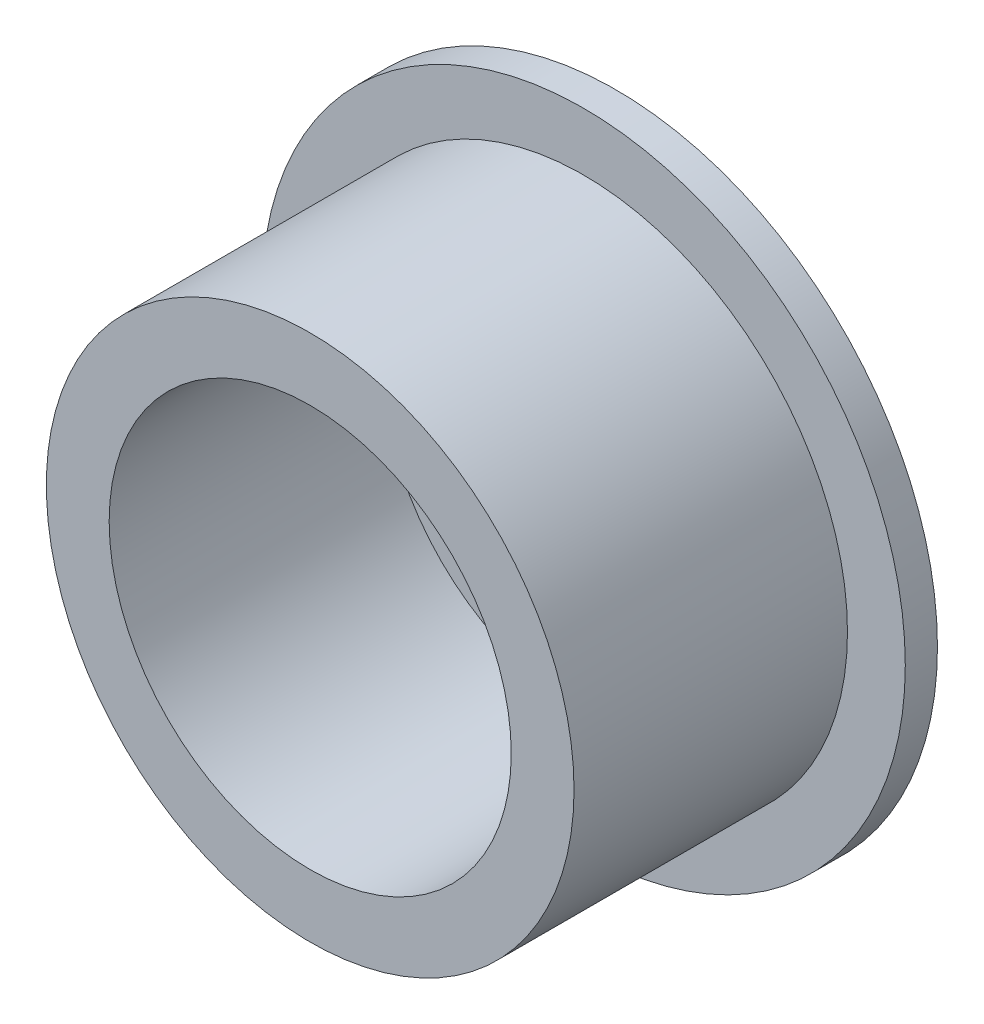
ISO-10303-21;
HEADER;
FILE_DESCRIPTION(('STEP AP214'),'2;1');
FILE_NAME('part.step','',(''),(''),'','','');
FILE_SCHEMA(('AUTOMOTIVE_DESIGN { 1 0 10303 214 1 1 1 1 }'));
ENDSEC;
DATA;
#1=APPLICATION_CONTEXT('core data for automotive mechanical design processes');
#2=APPLICATION_PROTOCOL_DEFINITION('international standard','automotive_design',2000,#1);
#3=PRODUCT_CONTEXT('',#1,'mechanical');
#4=PRODUCT('Part','Part','',(#3));
#5=PRODUCT_RELATED_PRODUCT_CATEGORY('part','',(#4));
#6=PRODUCT_DEFINITION_FORMATION('','',#4);
#7=PRODUCT_DEFINITION_CONTEXT('part definition',#1,'design');
#8=PRODUCT_DEFINITION('design','',#6,#7);
#9=PRODUCT_DEFINITION_SHAPE('','',#8);
#10=(LENGTH_UNIT() NAMED_UNIT(*) SI_UNIT(.MILLI.,.METRE.));
#11=(NAMED_UNIT(*) PLANE_ANGLE_UNIT() SI_UNIT($,.RADIAN.));
#12=(NAMED_UNIT(*) SI_UNIT($,.STERADIAN.) SOLID_ANGLE_UNIT());
#13=UNCERTAINTY_MEASURE_WITH_UNIT(LENGTH_MEASURE(1.E-05),#10,'distance_accuracy_value','');
#14=(GEOMETRIC_REPRESENTATION_CONTEXT(3) GLOBAL_UNCERTAINTY_ASSIGNED_CONTEXT((#13)) GLOBAL_UNIT_ASSIGNED_CONTEXT((#10,
#11,#12)) REPRESENTATION_CONTEXT('',''));
#15=CARTESIAN_POINT('',(0.,0.,0.));
#16=DIRECTION('',(0.,0.,1.));
#17=DIRECTION('',(1.,0.,0.));
#18=AXIS2_PLACEMENT_3D('',#15,#16,#17);
#19=CARTESIAN_POINT('',(0.,0.,2.));
#20=DIRECTION('',(0.,0.,1.));
#21=DIRECTION('',(1.,0.,0.));
#22=AXIS2_PLACEMENT_3D('',#19,#20,#21);
#23=PLANE('',#22);
#24=CARTESIAN_POINT('',(0.,0.,2.));
#25=DIRECTION('',(0.,0.,1.));
#26=DIRECTION('',(1.,0.,0.));
#27=AXIS2_PLACEMENT_3D('',#24,#25,#26);
#28=CIRCLE('',#27,7.62);
#29=CARTESIAN_POINT('',(7.62,0.,2.));
#30=VERTEX_POINT('',#29);
#31=EDGE_CURVE('E115',#30,#30,#28,.T.);
#32=ORIENTED_EDGE('',*,*,#31,.F.);
#33=EDGE_LOOP('',(#32));
#34=FACE_BOUND('',#33,.T.);
#35=CARTESIAN_POINT('',(-9.99999999999958,-4.2632564145606E-13,2.));
#36=DIRECTION('',(0.,0.,1.));
#37=DIRECTION('',(1.,0.,0.));
#38=AXIS2_PLACEMENT_3D('',#35,#36,#37);
#39=CIRCLE('',#38,1.50000000000063);
#40=CARTESIAN_POINT('',(-8.49999999999894,-4.2632564145606E-13,2.));
#41=VERTEX_POINT('',#40);
#42=EDGE_CURVE('E52',#41,#41,#39,.T.);
#43=ORIENTED_EDGE('',*,*,#42,.F.);
#44=EDGE_LOOP('',(#43));
#45=FACE_BOUND('',#44,.T.);
#46=CARTESIAN_POINT('',(10.0000000000004,4.25100994656913E-13,2.));
#47=DIRECTION('',(0.,0.,1.));
#48=DIRECTION('',(1.,0.,0.));
#49=AXIS2_PLACEMENT_3D('',#46,#47,#48);
#50=CIRCLE('',#49,1.50000000000032);
#51=CARTESIAN_POINT('',(11.5000000000007,4.25100994656913E-13,2.));
#52=VERTEX_POINT('',#51);
#53=EDGE_CURVE('E65',#52,#52,#50,.T.);
#54=ORIENTED_EDGE('',*,*,#53,.F.);
#55=EDGE_LOOP('',(#54));
#56=FACE_BOUND('',#55,.T.);
#57=CARTESIAN_POINT('',(0.,10.,2.));
#58=DIRECTION('',(0.,0.,1.));
#59=DIRECTION('',(1.,0.,0.));
#60=AXIS2_PLACEMENT_3D('',#57,#58,#59);
#61=CIRCLE('',#60,1.5);
#62=CARTESIAN_POINT('',(1.5,10.,2.));
#63=VERTEX_POINT('',#62);
#64=EDGE_CURVE('E71',#63,#63,#61,.T.);
#65=ORIENTED_EDGE('',*,*,#64,.F.);
#66=EDGE_LOOP('',(#65));
#67=FACE_BOUND('',#66,.T.);
#68=CARTESIAN_POINT('',(8.50201989313825E-13,-10.,2.));
#69=DIRECTION('',(0.,0.,1.));
#70=DIRECTION('',(1.,0.,0.));
#71=AXIS2_PLACEMENT_3D('',#68,#69,#70);
#72=CIRCLE('',#71,1.50000000000088);
#73=CARTESIAN_POINT('',(1.50000000000173,-10.,2.));
#74=VERTEX_POINT('',#73);
#75=EDGE_CURVE('E59',#74,#74,#72,.T.);
#76=ORIENTED_EDGE('',*,*,#75,.F.);
#77=EDGE_LOOP('',(#76));
#78=FACE_BOUND('',#77,.T.);
#79=CARTESIAN_POINT('',(0.,0.,2.));
#80=DIRECTION('',(0.,0.,1.));
#81=DIRECTION('',(1.,0.,0.));
#82=AXIS2_PLACEMENT_3D('',#79,#80,#81);
#83=CIRCLE('',#82,12.5);
#84=CARTESIAN_POINT('',(12.5,0.,2.));
#85=VERTEX_POINT('',#84);
#86=EDGE_CURVE('E118',#85,#85,#83,.T.);
#87=ORIENTED_EDGE('',*,*,#86,.T.);
#88=EDGE_LOOP('',(#87));
#89=FACE_BOUND('',#88,.T.);
#90=ADVANCED_FACE('F35',(#34,#45,#56,#67,#78,#89),#23,.T.);
#91=CARTESIAN_POINT('',(0.,0.,2.));
#92=DIRECTION('',(0.,0.,1.));
#93=DIRECTION('',(1.,0.,0.));
#94=AXIS2_PLACEMENT_3D('',#91,#92,#93);
#95=CIRCLE('',#94,16.405);
#96=CARTESIAN_POINT('',(16.405,0.,2.));
#97=VERTEX_POINT('',#96);
#98=EDGE_CURVE('E10',#97,#97,#95,.T.);
#99=ORIENTED_EDGE('',*,*,#98,.F.);
#100=EDGE_LOOP('',(#99));
#101=FACE_BOUND('',#100,.T.);
#102=CARTESIAN_POINT('',(0.,0.,2.));
#103=DIRECTION('',(0.,0.,1.));
#104=DIRECTION('',(1.,0.,0.));
#105=AXIS2_PLACEMENT_3D('',#102,#103,#104);
#106=CIRCLE('',#105,20.);
#107=CARTESIAN_POINT('',(20.,0.,2.));
#108=VERTEX_POINT('',#107);
#109=EDGE_CURVE('E43',#108,#108,#106,.T.);
#110=ORIENTED_EDGE('',*,*,#109,.T.);
#111=EDGE_LOOP('',(#110));
#112=FACE_BOUND('',#111,.T.);
#113=ADVANCED_FACE('F95',(#101,#112),#23,.T.);
#114=CARTESIAN_POINT('',(0.,0.,0.));
#115=DIRECTION('',(0.,0.,1.));
#116=DIRECTION('',(1.,0.,0.));
#117=AXIS2_PLACEMENT_3D('',#114,#115,#116);
#118=PLANE('',#117);
#119=CARTESIAN_POINT('',(0.,0.,0.));
#120=DIRECTION('',(0.,0.,-1.));
#121=DIRECTION('',(-1.,0.,0.));
#122=AXIS2_PLACEMENT_3D('',#119,#120,#121);
#123=CIRCLE('',#122,7.62);
#124=CARTESIAN_POINT('',(-7.62,0.,0.));
#125=VERTEX_POINT('',#124);
#126=EDGE_CURVE('E110',#125,#125,#123,.T.);
#127=ORIENTED_EDGE('',*,*,#126,.F.);
#128=EDGE_LOOP('',(#127));
#129=FACE_BOUND('',#128,.T.);
#130=CARTESIAN_POINT('',(0.,0.,0.));
#131=DIRECTION('',(0.,0.,1.));
#132=DIRECTION('',(1.,0.,0.));
#133=AXIS2_PLACEMENT_3D('',#130,#131,#132);
#134=CIRCLE('',#133,20.);
#135=CARTESIAN_POINT('',(20.,0.,0.));
#136=VERTEX_POINT('',#135);
#137=EDGE_CURVE('E39',#136,#136,#134,.T.);
#138=ORIENTED_EDGE('',*,*,#137,.F.);
#139=EDGE_LOOP('',(#138));
#140=FACE_BOUND('',#139,.T.);
#141=CARTESIAN_POINT('',(0.,10.,0.));
#142=DIRECTION('',(0.,0.,1.));
#143=DIRECTION('',(1.,0.,0.));
#144=AXIS2_PLACEMENT_3D('',#141,#142,#143);
#145=CIRCLE('',#144,1.5);
#146=CARTESIAN_POINT('',(1.5,10.,0.));
#147=VERTEX_POINT('',#146);
#148=EDGE_CURVE('E68',#147,#147,#145,.T.);
#149=ORIENTED_EDGE('',*,*,#148,.T.);
#150=EDGE_LOOP('',(#149));
#151=FACE_BOUND('',#150,.T.);
#152=CARTESIAN_POINT('',(10.0000000000004,4.25100994656913E-13,0.));
#153=DIRECTION('',(0.,0.,1.));
#154=DIRECTION('',(1.,0.,0.));
#155=AXIS2_PLACEMENT_3D('',#152,#153,#154);
#156=CIRCLE('',#155,1.50000000000032);
#157=CARTESIAN_POINT('',(11.5000000000007,4.25100994656913E-13,0.));
#158=VERTEX_POINT('',#157);
#159=EDGE_CURVE('E62',#158,#158,#156,.T.);
#160=ORIENTED_EDGE('',*,*,#159,.T.);
#161=EDGE_LOOP('',(#160));
#162=FACE_BOUND('',#161,.T.);
#163=CARTESIAN_POINT('',(8.50201989313825E-13,-10.,0.));
#164=DIRECTION('',(0.,0.,1.));
#165=DIRECTION('',(1.,0.,0.));
#166=AXIS2_PLACEMENT_3D('',#163,#164,#165);
#167=CIRCLE('',#166,1.50000000000088);
#168=CARTESIAN_POINT('',(1.50000000000173,-10.,0.));
#169=VERTEX_POINT('',#168);
#170=EDGE_CURVE('E55',#169,#169,#167,.T.);
#171=ORIENTED_EDGE('',*,*,#170,.T.);
#172=EDGE_LOOP('',(#171));
#173=FACE_BOUND('',#172,.T.);
#174=CARTESIAN_POINT('',(-9.99999999999958,-4.2632564145606E-13,0.));
#175=DIRECTION('',(0.,0.,1.));
#176=DIRECTION('',(1.,0.,0.));
#177=AXIS2_PLACEMENT_3D('',#174,#175,#176);
#178=CIRCLE('',#177,1.50000000000063);
#179=CARTESIAN_POINT('',(-8.49999999999894,-4.2632564145606E-13,0.));
#180=VERTEX_POINT('',#179);
#181=EDGE_CURVE('E56',#180,#180,#178,.T.);
#182=ORIENTED_EDGE('',*,*,#181,.T.);
#183=EDGE_LOOP('',(#182));
#184=FACE_BOUND('',#183,.T.);
#185=ADVANCED_FACE('F77',(#129,#140,#151,#162,#173,#184),#118,.F.);
#186=CARTESIAN_POINT('',(0.,0.,2.));
#187=DIRECTION('',(0.,0.,-1.));
#188=DIRECTION('',(-1.,0.,0.));
#189=AXIS2_PLACEMENT_3D('',#186,#187,#188);
#190=CYLINDRICAL_SURFACE('',#189,20.);
#191=ORIENTED_EDGE('',*,*,#109,.F.);
#192=EDGE_LOOP('',(#191));
#193=FACE_BOUND('',#192,.T.);
#194=ORIENTED_EDGE('',*,*,#137,.T.);
#195=EDGE_LOOP('',(#194));
#196=FACE_BOUND('',#195,.T.);
#197=ADVANCED_FACE('F37',(#193,#196),#190,.T.);
#198=CARTESIAN_POINT('',(0.,10.,2.));
#199=DIRECTION('',(0.,0.,-1.));
#200=DIRECTION('',(-1.,0.,0.));
#201=AXIS2_PLACEMENT_3D('',#198,#199,#200);
#202=CYLINDRICAL_SURFACE('',#201,1.5);
#203=ORIENTED_EDGE('',*,*,#64,.T.);
#204=EDGE_LOOP('',(#203));
#205=FACE_BOUND('',#204,.T.);
#206=ORIENTED_EDGE('',*,*,#148,.F.);
#207=EDGE_LOOP('',(#206));
#208=FACE_BOUND('',#207,.T.);
#209=ADVANCED_FACE('F80',(#205,#208),#202,.F.);
#210=CARTESIAN_POINT('',(10.0000000000004,4.25100994656913E-13,2.));
#211=DIRECTION('',(0.,0.,-1.));
#212=DIRECTION('',(-1.,0.,0.));
#213=AXIS2_PLACEMENT_3D('',#210,#211,#212);
#214=CYLINDRICAL_SURFACE('',#213,1.50000000000032);
#215=ORIENTED_EDGE('',*,*,#53,.T.);
#216=EDGE_LOOP('',(#215));
#217=FACE_BOUND('',#216,.T.);
#218=ORIENTED_EDGE('',*,*,#159,.F.);
#219=EDGE_LOOP('',(#218));
#220=FACE_BOUND('',#219,.T.);
#221=ADVANCED_FACE('F82',(#217,#220),#214,.F.);
#222=CARTESIAN_POINT('',(8.50201989313825E-13,-10.,2.));
#223=DIRECTION('',(0.,0.,-1.));
#224=DIRECTION('',(-1.,0.,0.));
#225=AXIS2_PLACEMENT_3D('',#222,#223,#224);
#226=CYLINDRICAL_SURFACE('',#225,1.50000000000088);
#227=ORIENTED_EDGE('',*,*,#75,.T.);
#228=EDGE_LOOP('',(#227));
#229=FACE_BOUND('',#228,.T.);
#230=ORIENTED_EDGE('',*,*,#170,.F.);
#231=EDGE_LOOP('',(#230));
#232=FACE_BOUND('',#231,.T.);
#233=ADVANCED_FACE('F89',(#229,#232),#226,.F.);
#234=CARTESIAN_POINT('',(-9.99999999999958,-4.2632564145606E-13,2.));
#235=DIRECTION('',(0.,0.,-1.));
#236=DIRECTION('',(-1.,0.,0.));
#237=AXIS2_PLACEMENT_3D('',#234,#235,#236);
#238=CYLINDRICAL_SURFACE('',#237,1.50000000000063);
#239=ORIENTED_EDGE('',*,*,#42,.T.);
#240=EDGE_LOOP('',(#239));
#241=FACE_BOUND('',#240,.T.);
#242=ORIENTED_EDGE('',*,*,#181,.F.);
#243=EDGE_LOOP('',(#242));
#244=FACE_BOUND('',#243,.T.);
#245=ADVANCED_FACE('F144',(#241,#244),#238,.F.);
#246=CARTESIAN_POINT('',(0.,0.,19.));
#247=DIRECTION('',(0.,0.,1.));
#248=DIRECTION('',(1.,0.,0.));
#249=AXIS2_PLACEMENT_3D('',#246,#247,#248);
#250=PLANE('',#249);
#251=CARTESIAN_POINT('',(0.,0.,19.));
#252=DIRECTION('',(0.,0.,1.));
#253=DIRECTION('',(1.,0.,0.));
#254=AXIS2_PLACEMENT_3D('',#251,#252,#253);
#255=CIRCLE('',#254,16.405);
#256=CARTESIAN_POINT('',(16.405,0.,19.));
#257=VERTEX_POINT('',#256);
#258=EDGE_CURVE('E50',#257,#257,#255,.T.);
#259=ORIENTED_EDGE('',*,*,#258,.T.);
#260=EDGE_LOOP('',(#259));
#261=FACE_BOUND('',#260,.T.);
#262=CARTESIAN_POINT('',(0.,0.,19.));
#263=DIRECTION('',(0.,0.,1.));
#264=DIRECTION('',(1.,0.,0.));
#265=AXIS2_PLACEMENT_3D('',#262,#263,#264);
#266=CIRCLE('',#265,12.5);
#267=CARTESIAN_POINT('',(12.5,0.,19.));
#268=VERTEX_POINT('',#267);
#269=EDGE_CURVE('E121',#268,#268,#266,.T.);
#270=ORIENTED_EDGE('',*,*,#269,.F.);
#271=EDGE_LOOP('',(#270));
#272=FACE_BOUND('',#271,.T.);
#273=ADVANCED_FACE('F139',(#261,#272),#250,.T.);
#274=CARTESIAN_POINT('',(0.,0.,19.));
#275=DIRECTION('',(0.,0.,-1.));
#276=DIRECTION('',(-1.,0.,0.));
#277=AXIS2_PLACEMENT_3D('',#274,#275,#276);
#278=CYLINDRICAL_SURFACE('',#277,16.405);
#279=ORIENTED_EDGE('',*,*,#258,.F.);
#280=EDGE_LOOP('',(#279));
#281=FACE_BOUND('',#280,.T.);
#282=ORIENTED_EDGE('',*,*,#98,.T.);
#283=EDGE_LOOP('',(#282));
#284=FACE_BOUND('',#283,.T.);
#285=ADVANCED_FACE('F130',(#281,#284),#278,.T.);
#286=CARTESIAN_POINT('',(0.,0.,19.));
#287=DIRECTION('',(0.,0.,-1.));
#288=DIRECTION('',(-1.,0.,0.));
#289=AXIS2_PLACEMENT_3D('',#286,#287,#288);
#290=CYLINDRICAL_SURFACE('',#289,12.5);
#291=ORIENTED_EDGE('',*,*,#269,.T.);
#292=EDGE_LOOP('',(#291));
#293=FACE_BOUND('',#292,.T.);
#294=ORIENTED_EDGE('',*,*,#86,.F.);
#295=EDGE_LOOP('',(#294));
#296=FACE_BOUND('',#295,.T.);
#297=ADVANCED_FACE('F127',(#293,#296),#290,.F.);
#298=CARTESIAN_POINT('',(0.,0.,17.));
#299=DIRECTION('',(0.,0.,-1.));
#300=DIRECTION('',(-1.,0.,0.));
#301=AXIS2_PLACEMENT_3D('',#298,#299,#300);
#302=CYLINDRICAL_SURFACE('',#301,7.62);
#303=ORIENTED_EDGE('',*,*,#31,.T.);
#304=EDGE_LOOP('',(#303));
#305=FACE_BOUND('',#304,.T.);
#306=ORIENTED_EDGE('',*,*,#126,.T.);
#307=EDGE_LOOP('',(#306));
#308=FACE_BOUND('',#307,.T.);
#309=ADVANCED_FACE('F129',(#305,#308),#302,.F.);
#310=CLOSED_SHELL('',(#90,#113,#185,#197,#209,#221,#233,#245,#273,#285,#297,#309));
#311=MANIFOLD_SOLID_BREP('B2',#310);
#312=ADVANCED_BREP_SHAPE_REPRESENTATION('',(#18,#311),#14);
#313=SHAPE_DEFINITION_REPRESENTATION(#9,#312);
ENDSEC;
END-ISO-10303-21;
